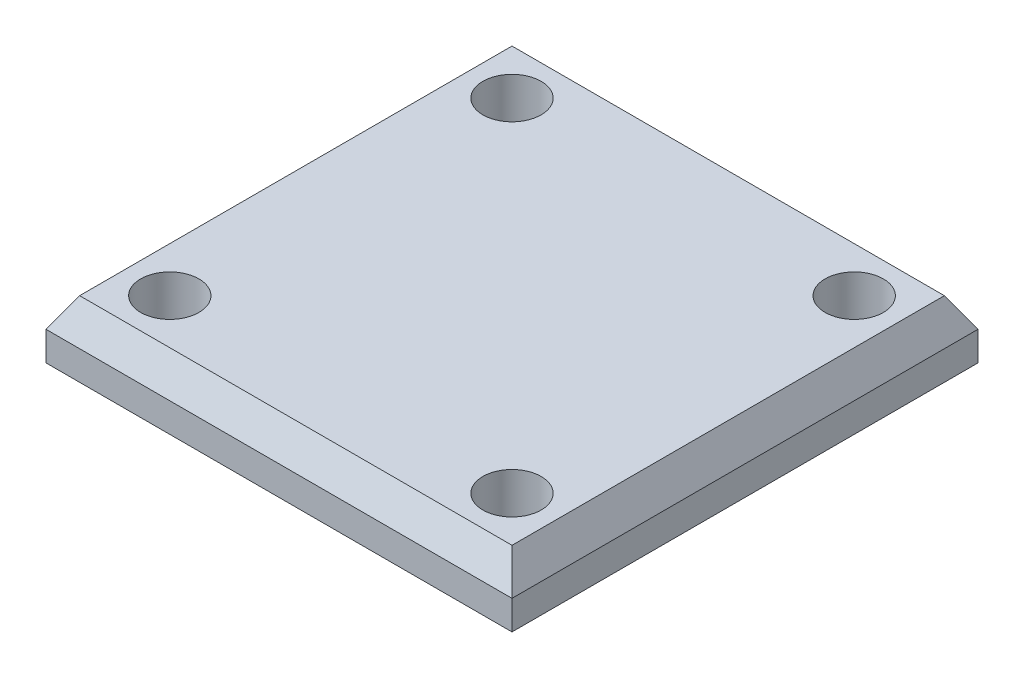
ISO-10303-21;
HEADER;
FILE_DESCRIPTION(('STEP AP214'),'2;1');
FILE_NAME('part.step','',(''),(''),'','','');
FILE_SCHEMA(('AUTOMOTIVE_DESIGN { 1 0 10303 214 1 1 1 1 }'));
ENDSEC;
DATA;
#1=APPLICATION_CONTEXT('core data for automotive mechanical design processes');
#2=APPLICATION_PROTOCOL_DEFINITION('international standard','automotive_design',2000,#1);
#3=PRODUCT_CONTEXT('',#1,'mechanical');
#4=PRODUCT('Part','Part','',(#3));
#5=PRODUCT_RELATED_PRODUCT_CATEGORY('part','',(#4));
#6=PRODUCT_DEFINITION_FORMATION('','',#4);
#7=PRODUCT_DEFINITION_CONTEXT('part definition',#1,'design');
#8=PRODUCT_DEFINITION('design','',#6,#7);
#9=PRODUCT_DEFINITION_SHAPE('','',#8);
#10=(LENGTH_UNIT() NAMED_UNIT(*) SI_UNIT(.MILLI.,.METRE.));
#11=(NAMED_UNIT(*) PLANE_ANGLE_UNIT() SI_UNIT($,.RADIAN.));
#12=(NAMED_UNIT(*) SI_UNIT($,.STERADIAN.) SOLID_ANGLE_UNIT());
#13=UNCERTAINTY_MEASURE_WITH_UNIT(LENGTH_MEASURE(1.E-05),#10,'distance_accuracy_value','');
#14=(GEOMETRIC_REPRESENTATION_CONTEXT(3) GLOBAL_UNCERTAINTY_ASSIGNED_CONTEXT((#13)) GLOBAL_UNIT_ASSIGNED_CONTEXT((#10,
#11,#12)) REPRESENTATION_CONTEXT('',''));
#15=CARTESIAN_POINT('',(0.,0.,0.));
#16=DIRECTION('',(0.,0.,1.));
#17=DIRECTION('',(1.,0.,0.));
#18=AXIS2_PLACEMENT_3D('',#15,#16,#17);
#19=CARTESIAN_POINT('',(16.,4.,16.));
#20=DIRECTION('',(-1.,0.,0.));
#21=DIRECTION('',(0.,0.,1.));
#22=AXIS2_PLACEMENT_3D('',#19,#20,#21);
#23=PLANE('',#22);
#24=DIRECTION('',(0.,-1.,0.));
#25=VECTOR('',#24,1.);
#26=CARTESIAN_POINT('',(16.,4.,-16.));
#27=LINE('',#26,#25);
#28=CARTESIAN_POINT('',(16.,2.,-16.));
#29=VERTEX_POINT('',#28);
#30=CARTESIAN_POINT('',(16.,0.,-16.));
#31=VERTEX_POINT('',#30);
#32=EDGE_CURVE('E98',#29,#31,#27,.T.);
#33=ORIENTED_EDGE('',*,*,#32,.F.);
#34=DIRECTION('',(0.,0.,1.));
#35=VECTOR('',#34,1.);
#36=CARTESIAN_POINT('',(16.,2.,16.));
#37=LINE('',#36,#35);
#38=CARTESIAN_POINT('',(16.,2.,16.));
#39=VERTEX_POINT('',#38);
#40=EDGE_CURVE('E55',#29,#39,#37,.T.);
#41=ORIENTED_EDGE('',*,*,#40,.T.);
#42=DIRECTION('',(0.,-1.,0.));
#43=VECTOR('',#42,1.);
#44=CARTESIAN_POINT('',(16.,4.,16.));
#45=LINE('',#44,#43);
#46=CARTESIAN_POINT('',(16.,0.,16.));
#47=VERTEX_POINT('',#46);
#48=EDGE_CURVE('E115',#39,#47,#45,.T.);
#49=ORIENTED_EDGE('',*,*,#48,.T.);
#50=DIRECTION('',(0.,0.,-1.));
#51=VECTOR('',#50,1.);
#52=CARTESIAN_POINT('',(16.,0.,16.));
#53=LINE('',#52,#51);
#54=EDGE_CURVE('E111',#47,#31,#53,.T.);
#55=ORIENTED_EDGE('',*,*,#54,.T.);
#56=EDGE_LOOP('',(#33,#41,#49,#55));
#57=FACE_BOUND('',#56,.T.);
#58=ADVANCED_FACE('F45',(#57),#23,.F.);
#59=CARTESIAN_POINT('',(-16.,4.,-16.));
#60=DIRECTION('',(0.,0.,1.));
#61=DIRECTION('',(1.,0.,0.));
#62=AXIS2_PLACEMENT_3D('',#59,#60,#61);
#63=PLANE('',#62);
#64=DIRECTION('',(0.,-1.,0.));
#65=VECTOR('',#64,1.);
#66=CARTESIAN_POINT('',(-16.,4.,-16.));
#67=LINE('',#66,#65);
#68=CARTESIAN_POINT('',(-16.,2.,-16.));
#69=VERTEX_POINT('',#68);
#70=CARTESIAN_POINT('',(-16.,0.,-16.));
#71=VERTEX_POINT('',#70);
#72=EDGE_CURVE('E105',#69,#71,#67,.T.);
#73=ORIENTED_EDGE('',*,*,#72,.F.);
#74=DIRECTION('',(1.,0.,0.));
#75=VECTOR('',#74,1.);
#76=CARTESIAN_POINT('',(-16.,2.,-16.));
#77=LINE('',#76,#75);
#78=EDGE_CURVE('E70',#69,#29,#77,.T.);
#79=ORIENTED_EDGE('',*,*,#78,.T.);
#80=ORIENTED_EDGE('',*,*,#32,.T.);
#81=DIRECTION('',(-1.,0.,0.));
#82=VECTOR('',#81,1.);
#83=CARTESIAN_POINT('',(-16.,0.,-16.));
#84=LINE('',#83,#82);
#85=EDGE_CURVE('E101',#31,#71,#84,.T.);
#86=ORIENTED_EDGE('',*,*,#85,.T.);
#87=EDGE_LOOP('',(#73,#79,#80,#86));
#88=FACE_BOUND('',#87,.T.);
#89=ADVANCED_FACE('F100',(#88),#63,.F.);
#90=CARTESIAN_POINT('',(-16.,4.,16.));
#91=DIRECTION('',(1.,0.,0.));
#92=DIRECTION('',(0.,0.,-1.));
#93=AXIS2_PLACEMENT_3D('',#90,#91,#92);
#94=PLANE('',#93);
#95=DIRECTION('',(0.,-1.,0.));
#96=VECTOR('',#95,1.);
#97=CARTESIAN_POINT('',(-16.,4.,16.));
#98=LINE('',#97,#96);
#99=CARTESIAN_POINT('',(-16.,2.,16.));
#100=VERTEX_POINT('',#99);
#101=CARTESIAN_POINT('',(-16.,0.,16.));
#102=VERTEX_POINT('',#101);
#103=EDGE_CURVE('E128',#100,#102,#98,.T.);
#104=ORIENTED_EDGE('',*,*,#103,.F.);
#105=DIRECTION('',(0.,0.,-1.));
#106=VECTOR('',#105,1.);
#107=CARTESIAN_POINT('',(-16.,2.,16.));
#108=LINE('',#107,#106);
#109=EDGE_CURVE('E139',#100,#69,#108,.T.);
#110=ORIENTED_EDGE('',*,*,#109,.T.);
#111=ORIENTED_EDGE('',*,*,#72,.T.);
#112=DIRECTION('',(0.,0.,1.));
#113=VECTOR('',#112,1.);
#114=CARTESIAN_POINT('',(-16.,0.,16.));
#115=LINE('',#114,#113);
#116=EDGE_CURVE('E113',#71,#102,#115,.T.);
#117=ORIENTED_EDGE('',*,*,#116,.T.);
#118=EDGE_LOOP('',(#104,#110,#111,#117));
#119=FACE_BOUND('',#118,.T.);
#120=ADVANCED_FACE('F195',(#119),#94,.F.);
#121=CARTESIAN_POINT('',(-16.,4.,16.));
#122=DIRECTION('',(0.,0.,-1.));
#123=DIRECTION('',(-1.,0.,0.));
#124=AXIS2_PLACEMENT_3D('',#121,#122,#123);
#125=PLANE('',#124);
#126=ORIENTED_EDGE('',*,*,#48,.F.);
#127=DIRECTION('',(-1.,0.,0.));
#128=VECTOR('',#127,1.);
#129=CARTESIAN_POINT('',(-16.,2.,16.));
#130=LINE('',#129,#128);
#131=EDGE_CURVE('E11',#39,#100,#130,.T.);
#132=ORIENTED_EDGE('',*,*,#131,.T.);
#133=ORIENTED_EDGE('',*,*,#103,.T.);
#134=DIRECTION('',(1.,0.,0.));
#135=VECTOR('',#134,1.);
#136=CARTESIAN_POINT('',(-16.,0.,16.));
#137=LINE('',#136,#135);
#138=EDGE_CURVE('E125',#102,#47,#137,.T.);
#139=ORIENTED_EDGE('',*,*,#138,.T.);
#140=EDGE_LOOP('',(#126,#132,#133,#139));
#141=FACE_BOUND('',#140,.T.);
#142=ADVANCED_FACE('F186',(#141),#125,.F.);
#143=CARTESIAN_POINT('',(0.,4.,0.));
#144=DIRECTION('',(0.,-1.,0.));
#145=DIRECTION('',(0.,0.,-1.));
#146=AXIS2_PLACEMENT_3D('',#143,#144,#145);
#147=PLANE('',#146);
#148=DIRECTION('',(-1.,0.,0.));
#149=VECTOR('',#148,1.);
#150=CARTESIAN_POINT('',(0.,4.,-14.8452994616208));
#151=LINE('',#150,#149);
#152=CARTESIAN_POINT('',(14.8452994616208,4.,-14.8452994616208));
#153=VERTEX_POINT('',#152);
#154=CARTESIAN_POINT('',(-14.8452994616208,4.,-14.8452994616208));
#155=VERTEX_POINT('',#154);
#156=EDGE_CURVE('E134',#153,#155,#151,.T.);
#157=ORIENTED_EDGE('',*,*,#156,.T.);
#158=DIRECTION('',(0.,0.,1.));
#159=VECTOR('',#158,1.);
#160=CARTESIAN_POINT('',(-14.8452994616208,4.,0.));
#161=LINE('',#160,#159);
#162=CARTESIAN_POINT('',(-14.8452994616208,4.,14.8452994616208));
#163=VERTEX_POINT('',#162);
#164=EDGE_CURVE('E136',#155,#163,#161,.T.);
#165=ORIENTED_EDGE('',*,*,#164,.T.);
#166=DIRECTION('',(1.,0.,0.));
#167=VECTOR('',#166,1.);
#168=CARTESIAN_POINT('',(0.,4.,14.8452994616208));
#169=LINE('',#168,#167);
#170=CARTESIAN_POINT('',(14.8452994616208,4.,14.8452994616208));
#171=VERTEX_POINT('',#170);
#172=EDGE_CURVE('E104',#163,#171,#169,.T.);
#173=ORIENTED_EDGE('',*,*,#172,.T.);
#174=DIRECTION('',(0.,0.,-1.));
#175=VECTOR('',#174,1.);
#176=CARTESIAN_POINT('',(14.8452994616208,4.,0.));
#177=LINE('',#176,#175);
#178=EDGE_CURVE('E132',#171,#153,#177,.T.);
#179=ORIENTED_EDGE('',*,*,#178,.T.);
#180=EDGE_LOOP('',(#157,#165,#173,#179));
#181=FACE_BOUND('',#180,.T.);
#182=CARTESIAN_POINT('',(-11.75,4.,11.75));
#183=DIRECTION('',(0.,1.,0.));
#184=DIRECTION('',(0.,0.,-1.));
#185=AXIS2_PLACEMENT_3D('',#182,#183,#184);
#186=CIRCLE('',#185,2.);
#187=CARTESIAN_POINT('',(-11.75,4.,9.75000000000001));
#188=VERTEX_POINT('',#187);
#189=EDGE_CURVE('E159',#188,#188,#186,.T.);
#190=ORIENTED_EDGE('',*,*,#189,.F.);
#191=EDGE_LOOP('',(#190));
#192=FACE_BOUND('',#191,.T.);
#193=CARTESIAN_POINT('',(11.75,4.,11.75));
#194=DIRECTION('',(0.,1.,0.));
#195=DIRECTION('',(0.,0.,1.));
#196=AXIS2_PLACEMENT_3D('',#193,#194,#195);
#197=CIRCLE('',#196,2.);
#198=CARTESIAN_POINT('',(11.75,4.,13.75));
#199=VERTEX_POINT('',#198);
#200=EDGE_CURVE('E169',#199,#199,#197,.T.);
#201=ORIENTED_EDGE('',*,*,#200,.F.);
#202=EDGE_LOOP('',(#201));
#203=FACE_BOUND('',#202,.T.);
#204=CARTESIAN_POINT('',(11.75,4.,-11.75));
#205=DIRECTION('',(0.,1.,0.));
#206=DIRECTION('',(0.,0.,-1.));
#207=AXIS2_PLACEMENT_3D('',#204,#205,#206);
#208=CIRCLE('',#207,2.);
#209=CARTESIAN_POINT('',(11.75,4.,-13.75));
#210=VERTEX_POINT('',#209);
#211=EDGE_CURVE('E175',#210,#210,#208,.T.);
#212=ORIENTED_EDGE('',*,*,#211,.F.);
#213=EDGE_LOOP('',(#212));
#214=FACE_BOUND('',#213,.T.);
#215=CARTESIAN_POINT('',(-11.75,4.,-11.75));
#216=DIRECTION('',(0.,1.,0.));
#217=DIRECTION('',(0.,0.,1.));
#218=AXIS2_PLACEMENT_3D('',#215,#216,#217);
#219=CIRCLE('',#218,2.);
#220=CARTESIAN_POINT('',(-11.75,4.,-9.75));
#221=VERTEX_POINT('',#220);
#222=EDGE_CURVE('E120',#221,#221,#219,.T.);
#223=ORIENTED_EDGE('',*,*,#222,.F.);
#224=EDGE_LOOP('',(#223));
#225=FACE_BOUND('',#224,.T.);
#226=ADVANCED_FACE('F184',(#181,#192,#203,#214,#225),#147,.F.);
#227=CARTESIAN_POINT('',(0.,0.,0.));
#228=DIRECTION('',(0.,-1.,0.));
#229=DIRECTION('',(0.,0.,-1.));
#230=AXIS2_PLACEMENT_3D('',#227,#228,#229);
#231=PLANE('',#230);
#232=ORIENTED_EDGE('',*,*,#54,.F.);
#233=ORIENTED_EDGE('',*,*,#138,.F.);
#234=ORIENTED_EDGE('',*,*,#116,.F.);
#235=ORIENTED_EDGE('',*,*,#85,.F.);
#236=EDGE_LOOP('',(#232,#233,#234,#235));
#237=FACE_BOUND('',#236,.T.);
#238=ADVANCED_FACE('F109',(#237),#231,.T.);
#239=CARTESIAN_POINT('',(-11.75,1.,-11.75));
#240=DIRECTION('',(0.,1.,0.));
#241=DIRECTION('',(0.,0.,1.));
#242=AXIS2_PLACEMENT_3D('',#239,#240,#241);
#243=CYLINDRICAL_SURFACE('',#242,2.);
#244=CARTESIAN_POINT('',(-11.75,1.,-11.75));
#245=DIRECTION('',(0.,1.,0.));
#246=DIRECTION('',(0.,0.,1.));
#247=AXIS2_PLACEMENT_3D('',#244,#245,#246);
#248=CIRCLE('',#247,2.);
#249=CARTESIAN_POINT('',(-11.75,1.,-9.75));
#250=VERTEX_POINT('',#249);
#251=EDGE_CURVE('E117',#250,#250,#248,.T.);
#252=ORIENTED_EDGE('',*,*,#251,.F.);
#253=EDGE_LOOP('',(#252));
#254=FACE_BOUND('',#253,.T.);
#255=ORIENTED_EDGE('',*,*,#222,.T.);
#256=EDGE_LOOP('',(#255));
#257=FACE_BOUND('',#256,.T.);
#258=ADVANCED_FACE('F182',(#254,#257),#243,.F.);
#259=CARTESIAN_POINT('',(-11.75,1.,-11.75));
#260=DIRECTION('',(0.,1.,0.));
#261=DIRECTION('',(0.,0.,1.));
#262=AXIS2_PLACEMENT_3D('',#259,#260,#261);
#263=PLANE('',#262);
#264=ORIENTED_EDGE('',*,*,#251,.T.);
#265=EDGE_LOOP('',(#264));
#266=FACE_BOUND('',#265,.T.);
#267=ADVANCED_FACE('F271',(#266),#263,.T.);
#268=CARTESIAN_POINT('',(11.75,1.,-11.75));
#269=DIRECTION('',(0.,1.,0.));
#270=DIRECTION('',(0.,0.,1.));
#271=AXIS2_PLACEMENT_3D('',#268,#269,#270);
#272=CYLINDRICAL_SURFACE('',#271,2.);
#273=CARTESIAN_POINT('',(11.75,1.,-11.75));
#274=DIRECTION('',(0.,1.,0.));
#275=DIRECTION('',(0.,0.,-1.));
#276=AXIS2_PLACEMENT_3D('',#273,#274,#275);
#277=CIRCLE('',#276,2.);
#278=CARTESIAN_POINT('',(11.75,1.,-13.75));
#279=VERTEX_POINT('',#278);
#280=EDGE_CURVE('E172',#279,#279,#277,.T.);
#281=ORIENTED_EDGE('',*,*,#280,.F.);
#282=EDGE_LOOP('',(#281));
#283=FACE_BOUND('',#282,.T.);
#284=ORIENTED_EDGE('',*,*,#211,.T.);
#285=EDGE_LOOP('',(#284));
#286=FACE_BOUND('',#285,.T.);
#287=ADVANCED_FACE('F280',(#283,#286),#272,.F.);
#288=CARTESIAN_POINT('',(11.75,1.,-11.75));
#289=DIRECTION('',(0.,-1.,0.));
#290=DIRECTION('',(0.,0.,-1.));
#291=AXIS2_PLACEMENT_3D('',#288,#289,#290);
#292=PLANE('',#291);
#293=ORIENTED_EDGE('',*,*,#280,.T.);
#294=EDGE_LOOP('',(#293));
#295=FACE_BOUND('',#294,.T.);
#296=ADVANCED_FACE('F290',(#295),#292,.F.);
#297=CARTESIAN_POINT('',(11.75,1.,11.75));
#298=DIRECTION('',(0.,1.,0.));
#299=DIRECTION('',(0.,0.,1.));
#300=AXIS2_PLACEMENT_3D('',#297,#298,#299);
#301=CYLINDRICAL_SURFACE('',#300,2.);
#302=CARTESIAN_POINT('',(11.75,1.,11.75));
#303=DIRECTION('',(0.,1.,0.));
#304=DIRECTION('',(0.,0.,1.));
#305=AXIS2_PLACEMENT_3D('',#302,#303,#304);
#306=CIRCLE('',#305,2.);
#307=CARTESIAN_POINT('',(11.75,1.,13.75));
#308=VERTEX_POINT('',#307);
#309=EDGE_CURVE('E164',#308,#308,#306,.T.);
#310=ORIENTED_EDGE('',*,*,#309,.F.);
#311=EDGE_LOOP('',(#310));
#312=FACE_BOUND('',#311,.T.);
#313=ORIENTED_EDGE('',*,*,#200,.T.);
#314=EDGE_LOOP('',(#313));
#315=FACE_BOUND('',#314,.T.);
#316=ADVANCED_FACE('F300',(#312,#315),#301,.F.);
#317=CARTESIAN_POINT('',(11.75,1.,11.75));
#318=DIRECTION('',(0.,1.,0.));
#319=DIRECTION('',(0.,0.,1.));
#320=AXIS2_PLACEMENT_3D('',#317,#318,#319);
#321=PLANE('',#320);
#322=ORIENTED_EDGE('',*,*,#309,.T.);
#323=EDGE_LOOP('',(#322));
#324=FACE_BOUND('',#323,.T.);
#325=ADVANCED_FACE('F310',(#324),#321,.T.);
#326=CARTESIAN_POINT('',(-11.75,1.,11.75));
#327=DIRECTION('',(0.,1.,0.));
#328=DIRECTION('',(0.,0.,1.));
#329=AXIS2_PLACEMENT_3D('',#326,#327,#328);
#330=CYLINDRICAL_SURFACE('',#329,2.);
#331=CARTESIAN_POINT('',(-11.75,1.,11.75));
#332=DIRECTION('',(0.,1.,0.));
#333=DIRECTION('',(0.,0.,-1.));
#334=AXIS2_PLACEMENT_3D('',#331,#332,#333);
#335=CIRCLE('',#334,2.);
#336=CARTESIAN_POINT('',(-11.75,1.,9.75000000000001));
#337=VERTEX_POINT('',#336);
#338=EDGE_CURVE('E154',#337,#337,#335,.T.);
#339=ORIENTED_EDGE('',*,*,#338,.F.);
#340=EDGE_LOOP('',(#339));
#341=FACE_BOUND('',#340,.T.);
#342=ORIENTED_EDGE('',*,*,#189,.T.);
#343=EDGE_LOOP('',(#342));
#344=FACE_BOUND('',#343,.T.);
#345=ADVANCED_FACE('F232',(#341,#344),#330,.F.);
#346=CARTESIAN_POINT('',(-11.75,1.,11.75));
#347=DIRECTION('',(0.,-1.,0.));
#348=DIRECTION('',(0.,0.,-1.));
#349=AXIS2_PLACEMENT_3D('',#346,#347,#348);
#350=PLANE('',#349);
#351=ORIENTED_EDGE('',*,*,#338,.T.);
#352=EDGE_LOOP('',(#351));
#353=FACE_BOUND('',#352,.T.);
#354=ADVANCED_FACE('F228',(#353),#350,.F.);
#355=CARTESIAN_POINT('',(14.8452994616208,4.,0.));
#356=DIRECTION('',(-0.866025403784439,-0.499999999999999,0.));
#357=DIRECTION('',(0.,0.,-1.));
#358=AXIS2_PLACEMENT_3D('',#355,#356,#357);
#359=PLANE('',#358);
#360=DIRECTION('',(-0.447213595499957,0.774596669241484,-0.447213595499957));
#361=VECTOR('',#360,1.);
#362=CARTESIAN_POINT('',(11.8762395692966,9.14256258422041,11.8762395692966));
#363=LINE('',#362,#361);
#364=EDGE_CURVE('E147',#39,#171,#363,.T.);
#365=ORIENTED_EDGE('',*,*,#364,.F.);
#366=ORIENTED_EDGE('',*,*,#40,.F.);
#367=DIRECTION('',(-0.447213595499957,0.774596669241484,0.447213595499957));
#368=VECTOR('',#367,1.);
#369=CARTESIAN_POINT('',(11.8762395692966,9.14256258422041,-11.8762395692966));
#370=LINE('',#369,#368);
#371=EDGE_CURVE('E50',#153,#29,#370,.F.);
#372=ORIENTED_EDGE('',*,*,#371,.F.);
#373=ORIENTED_EDGE('',*,*,#178,.F.);
#374=EDGE_LOOP('',(#365,#366,#372,#373));
#375=FACE_BOUND('',#374,.T.);
#376=ADVANCED_FACE('F48',(#375),#359,.F.);
#377=CARTESIAN_POINT('',(0.,4.,-14.8452994616208));
#378=DIRECTION('',(0.,-0.499999999999999,0.866025403784439));
#379=DIRECTION('',(-1.,0.,0.));
#380=AXIS2_PLACEMENT_3D('',#377,#378,#379);
#381=PLANE('',#380);
#382=ORIENTED_EDGE('',*,*,#371,.T.);
#383=ORIENTED_EDGE('',*,*,#78,.F.);
#384=DIRECTION('',(0.447213595499957,0.774596669241484,0.447213595499957));
#385=VECTOR('',#384,1.);
#386=CARTESIAN_POINT('',(-11.8762395692966,9.14256258422041,-11.8762395692966));
#387=LINE('',#386,#385);
#388=EDGE_CURVE('E146',#155,#69,#387,.F.);
#389=ORIENTED_EDGE('',*,*,#388,.F.);
#390=ORIENTED_EDGE('',*,*,#156,.F.);
#391=EDGE_LOOP('',(#382,#383,#389,#390));
#392=FACE_BOUND('',#391,.T.);
#393=ADVANCED_FACE('F222',(#392),#381,.F.);
#394=CARTESIAN_POINT('',(0.,4.,14.8452994616208));
#395=DIRECTION('',(0.,-0.499999999999999,-0.866025403784439));
#396=DIRECTION('',(1.,0.,0.));
#397=AXIS2_PLACEMENT_3D('',#394,#395,#396);
#398=PLANE('',#397);
#399=ORIENTED_EDGE('',*,*,#364,.T.);
#400=ORIENTED_EDGE('',*,*,#172,.F.);
#401=DIRECTION('',(-0.447213595499957,-0.774596669241484,0.447213595499957));
#402=VECTOR('',#401,1.);
#403=CARTESIAN_POINT('',(-11.8762395692966,9.14256258422041,11.8762395692966));
#404=LINE('',#403,#402);
#405=EDGE_CURVE('E144',#100,#163,#404,.F.);
#406=ORIENTED_EDGE('',*,*,#405,.F.);
#407=ORIENTED_EDGE('',*,*,#131,.F.);
#408=EDGE_LOOP('',(#399,#400,#406,#407));
#409=FACE_BOUND('',#408,.T.);
#410=ADVANCED_FACE('F216',(#409),#398,.F.);
#411=CARTESIAN_POINT('',(-14.8452994616208,4.,0.));
#412=DIRECTION('',(0.866025403784439,-0.499999999999999,0.));
#413=DIRECTION('',(0.,0.,1.));
#414=AXIS2_PLACEMENT_3D('',#411,#412,#413);
#415=PLANE('',#414);
#416=ORIENTED_EDGE('',*,*,#388,.T.);
#417=ORIENTED_EDGE('',*,*,#109,.F.);
#418=ORIENTED_EDGE('',*,*,#405,.T.);
#419=ORIENTED_EDGE('',*,*,#164,.F.);
#420=EDGE_LOOP('',(#416,#417,#418,#419));
#421=FACE_BOUND('',#420,.T.);
#422=ADVANCED_FACE('F210',(#421),#415,.F.);
#423=CLOSED_SHELL('',(#58,#89,#120,#142,#226,#238,#258,#267,#287,#296,#316,#325,#345,#354,#376,
#393,#410,#422));
#424=MANIFOLD_SOLID_BREP('B2',#423);
#425=ADVANCED_BREP_SHAPE_REPRESENTATION('',(#18,#424),#14);
#426=SHAPE_DEFINITION_REPRESENTATION(#9,#425);
ENDSEC;
END-ISO-10303-21;
